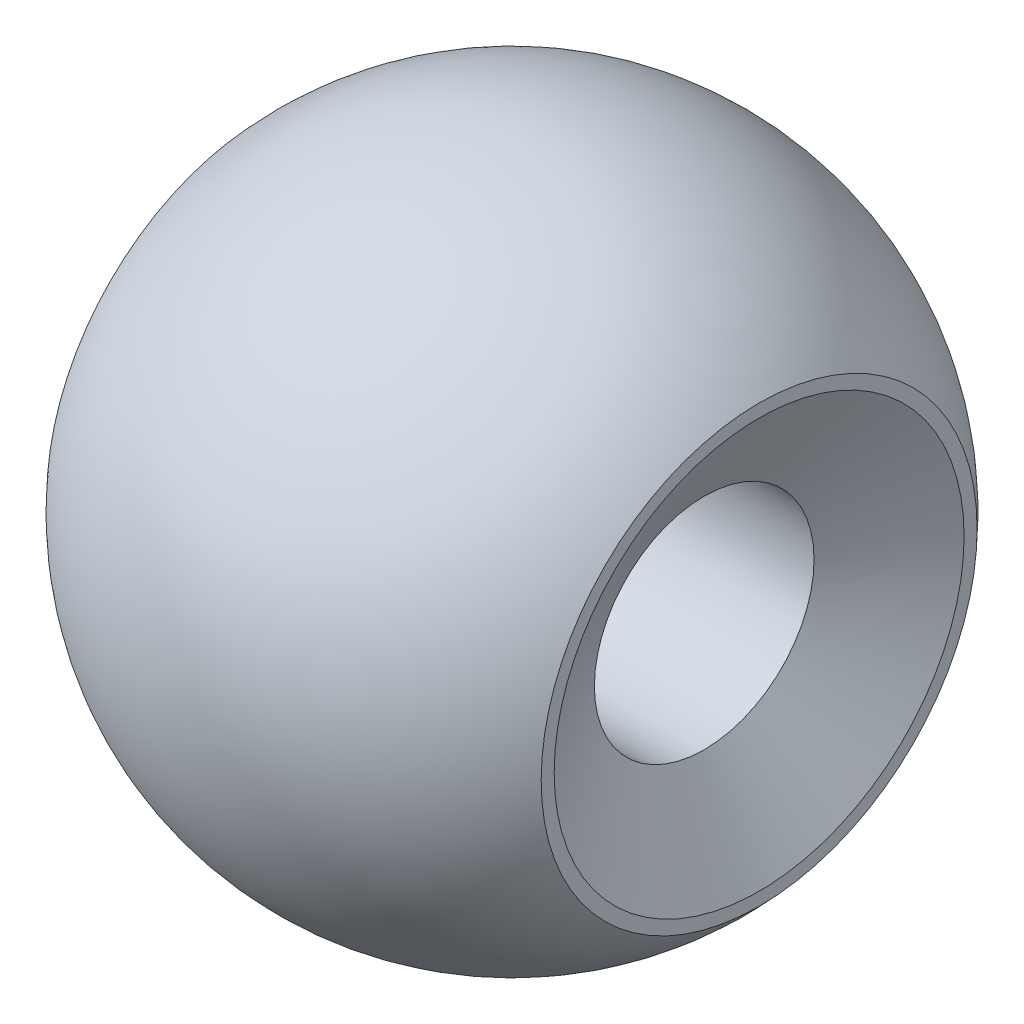
ISO-10303-21;
HEADER;
FILE_DESCRIPTION(('STEP AP214'),'2;1');
FILE_NAME('part.step','',(''),(''),'','','');
FILE_SCHEMA(('AUTOMOTIVE_DESIGN { 1 0 10303 214 1 1 1 1 }'));
ENDSEC;
DATA;
#1=APPLICATION_CONTEXT('core data for automotive mechanical design processes');
#2=APPLICATION_PROTOCOL_DEFINITION('international standard','automotive_design',2000,#1);
#3=PRODUCT_CONTEXT('',#1,'mechanical');
#4=PRODUCT('Part','Part','',(#3));
#5=PRODUCT_RELATED_PRODUCT_CATEGORY('part','',(#4));
#6=PRODUCT_DEFINITION_FORMATION('','',#4);
#7=PRODUCT_DEFINITION_CONTEXT('part definition',#1,'design');
#8=PRODUCT_DEFINITION('design','',#6,#7);
#9=PRODUCT_DEFINITION_SHAPE('','',#8);
#10=(LENGTH_UNIT() NAMED_UNIT(*) SI_UNIT(.MILLI.,.METRE.));
#11=(NAMED_UNIT(*) PLANE_ANGLE_UNIT() SI_UNIT($,.RADIAN.));
#12=(NAMED_UNIT(*) SI_UNIT($,.STERADIAN.) SOLID_ANGLE_UNIT());
#13=UNCERTAINTY_MEASURE_WITH_UNIT(LENGTH_MEASURE(1.E-05),#10,'distance_accuracy_value','');
#14=(GEOMETRIC_REPRESENTATION_CONTEXT(3) GLOBAL_UNCERTAINTY_ASSIGNED_CONTEXT((#13)) GLOBAL_UNIT_ASSIGNED_CONTEXT((#10,
#11,#12)) REPRESENTATION_CONTEXT('',''));
#15=CARTESIAN_POINT('',(0.,0.,0.));
#16=DIRECTION('',(0.,0.,1.));
#17=DIRECTION('',(1.,0.,0.));
#18=AXIS2_PLACEMENT_3D('',#15,#16,#17);
#19=CARTESIAN_POINT('',(0.,0.,0.));
#20=DIRECTION('',(0.,0.,-1.));
#21=DIRECTION('',(1.,0.,0.));
#22=AXIS2_PLACEMENT_3D('',#19,#20,#21);
#23=SPHERICAL_SURFACE('',#22,6.);
#24=CARTESIAN_POINT('',(0.,0.,0.));
#25=DIRECTION('',(1.,0.,0.));
#26=DIRECTION('',(0.,0.,-1.));
#27=AXIS2_PLACEMENT_3D('',#24,#25,#26);
#28=SPHERICAL_SURFACE('',#27,6.);
#29=CARTESIAN_POINT('',(-4.5,0.,0.));
#30=DIRECTION('',(1.,0.,0.));
#31=DIRECTION('',(0.,0.,-1.));
#32=AXIS2_PLACEMENT_3D('',#29,#30,#31);
#33=CIRCLE('',#32,3.96862696659689);
#34=CARTESIAN_POINT('',(-4.5,0.,-3.96862696659689));
#35=VERTEX_POINT('',#34);
#36=EDGE_CURVE('E50',#35,#35,#33,.F.);
#37=ORIENTED_EDGE('',*,*,#36,.F.);
#38=EDGE_LOOP('',(#37));
#39=FACE_BOUND('',#38,.T.);
#40=CARTESIAN_POINT('',(4.5,0.,0.));
#41=DIRECTION('',(-1.,0.,0.));
#42=DIRECTION('',(0.,0.,1.));
#43=AXIS2_PLACEMENT_3D('',#40,#41,#42);
#44=CIRCLE('',#43,3.96862696659689);
#45=CARTESIAN_POINT('',(4.5,0.,3.96862696659689));
#46=VERTEX_POINT('',#45);
#47=EDGE_CURVE('E55',#46,#46,#44,.F.);
#48=ORIENTED_EDGE('',*,*,#47,.F.);
#49=EDGE_LOOP('',(#48));
#50=FACE_BOUND('',#49,.T.);
#51=ADVANCED_FACE('F37',(#39,#50),#28,.T.);
#52=CARTESIAN_POINT('',(4.5,-10.,6.11661736511075));
#53=DIRECTION('',(-1.,0.,0.));
#54=DIRECTION('',(0.,0.,1.));
#55=AXIS2_PLACEMENT_3D('',#52,#53,#54);
#56=PLANE('',#55);
#57=CARTESIAN_POINT('',(4.5,0.,0.));
#58=DIRECTION('',(-1.,0.,0.));
#59=DIRECTION('',(0.,0.,1.));
#60=AXIS2_PLACEMENT_3D('',#57,#58,#59);
#61=CIRCLE('',#60,3.73205080756888);
#62=CARTESIAN_POINT('',(4.5,0.,3.73205080756888));
#63=VERTEX_POINT('',#62);
#64=EDGE_CURVE('E10',#63,#63,#61,.T.);
#65=ORIENTED_EDGE('',*,*,#64,.T.);
#66=EDGE_LOOP('',(#65));
#67=FACE_BOUND('',#66,.T.);
#68=ORIENTED_EDGE('',*,*,#47,.T.);
#69=EDGE_LOOP('',(#68));
#70=FACE_BOUND('',#69,.T.);
#71=ADVANCED_FACE('F71',(#67,#70),#56,.F.);
#72=CARTESIAN_POINT('',(-4.5,-10.,6.11661736511075));
#73=DIRECTION('',(1.,0.,0.));
#74=DIRECTION('',(0.,0.,-1.));
#75=AXIS2_PLACEMENT_3D('',#72,#73,#74);
#76=PLANE('',#75);
#77=CARTESIAN_POINT('',(-4.5,0.,0.));
#78=DIRECTION('',(1.,0.,0.));
#79=DIRECTION('',(0.,0.,-1.));
#80=AXIS2_PLACEMENT_3D('',#77,#78,#79);
#81=CIRCLE('',#80,2.);
#82=CARTESIAN_POINT('',(-4.5,0.,-2.));
#83=VERTEX_POINT('',#82);
#84=EDGE_CURVE('E61',#83,#83,#81,.F.);
#85=ORIENTED_EDGE('',*,*,#84,.F.);
#86=EDGE_LOOP('',(#85));
#87=FACE_BOUND('',#86,.T.);
#88=ORIENTED_EDGE('',*,*,#36,.T.);
#89=EDGE_LOOP('',(#88));
#90=FACE_BOUND('',#89,.T.);
#91=ADVANCED_FACE('F68',(#87,#90),#76,.F.);
#92=CARTESIAN_POINT('',(-4.501,0.,0.));
#93=DIRECTION('',(1.,0.,0.));
#94=DIRECTION('',(0.,0.,-1.));
#95=AXIS2_PLACEMENT_3D('',#92,#93,#94);
#96=CYLINDRICAL_SURFACE('',#95,2.);
#97=CARTESIAN_POINT('',(3.5,0.,0.));
#98=DIRECTION('',(-1.,0.,0.));
#99=DIRECTION('',(0.,0.,1.));
#100=AXIS2_PLACEMENT_3D('',#97,#98,#99);
#101=CIRCLE('',#100,2.);
#102=CARTESIAN_POINT('',(3.5,0.,2.));
#103=VERTEX_POINT('',#102);
#104=EDGE_CURVE('E45',#103,#103,#101,.F.);
#105=ORIENTED_EDGE('',*,*,#104,.T.);
#106=EDGE_LOOP('',(#105));
#107=FACE_BOUND('',#106,.T.);
#108=ORIENTED_EDGE('',*,*,#84,.T.);
#109=EDGE_LOOP('',(#108));
#110=FACE_BOUND('',#109,.T.);
#111=ADVANCED_FACE('F66',(#107,#110),#96,.F.);
#112=CARTESIAN_POINT('',(3.5,0.,0.));
#113=DIRECTION('',(1.,0.,0.));
#114=DIRECTION('',(0.,0.,-1.));
#115=AXIS2_PLACEMENT_3D('',#112,#113,#114);
#116=CONICAL_SURFACE('',#115,2.,1.0471975511966);
#117=ORIENTED_EDGE('',*,*,#64,.F.);
#118=EDGE_LOOP('',(#117));
#119=FACE_BOUND('',#118,.T.);
#120=ORIENTED_EDGE('',*,*,#104,.F.);
#121=EDGE_LOOP('',(#120));
#122=FACE_BOUND('',#121,.T.);
#123=ADVANCED_FACE('F39',(#119,#122),#116,.F.);
#124=CLOSED_SHELL('',(#51,#71,#91,#111,#123));
#125=MANIFOLD_SOLID_BREP('B2',#124);
#126=ADVANCED_BREP_SHAPE_REPRESENTATION('',(#18,#125),#14);
#127=SHAPE_DEFINITION_REPRESENTATION(#9,#126);
ENDSEC;
END-ISO-10303-21;
